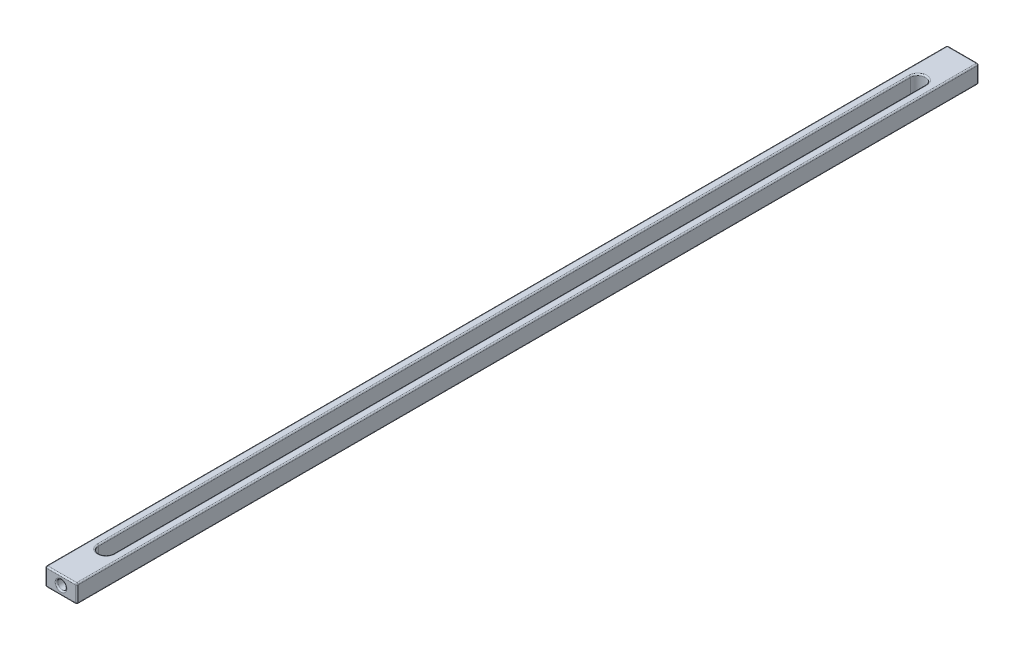
ISO-10303-21;
HEADER;
FILE_DESCRIPTION(('STEP AP214'),'2;1');
FILE_NAME('part.step','',(''),(''),'','','');
FILE_SCHEMA(('AUTOMOTIVE_DESIGN { 1 0 10303 214 1 1 1 1 }'));
ENDSEC;
DATA;
#1=APPLICATION_CONTEXT('core data for automotive mechanical design processes');
#2=APPLICATION_PROTOCOL_DEFINITION('international standard','automotive_design',2000,#1);
#3=PRODUCT_CONTEXT('',#1,'mechanical');
#4=PRODUCT('Part','Part','',(#3));
#5=PRODUCT_RELATED_PRODUCT_CATEGORY('part','',(#4));
#6=PRODUCT_DEFINITION_FORMATION('','',#4);
#7=PRODUCT_DEFINITION_CONTEXT('part definition',#1,'design');
#8=PRODUCT_DEFINITION('design','',#6,#7);
#9=PRODUCT_DEFINITION_SHAPE('','',#8);
#10=(LENGTH_UNIT() NAMED_UNIT(*) SI_UNIT(.MILLI.,.METRE.));
#11=(NAMED_UNIT(*) PLANE_ANGLE_UNIT() SI_UNIT($,.RADIAN.));
#12=(NAMED_UNIT(*) SI_UNIT($,.STERADIAN.) SOLID_ANGLE_UNIT());
#13=UNCERTAINTY_MEASURE_WITH_UNIT(LENGTH_MEASURE(1.E-05),#10,'distance_accuracy_value','');
#14=(GEOMETRIC_REPRESENTATION_CONTEXT(3) GLOBAL_UNCERTAINTY_ASSIGNED_CONTEXT((#13)) GLOBAL_UNIT_ASSIGNED_CONTEXT((#10,
#11,#12)) REPRESENTATION_CONTEXT('',''));
#15=CARTESIAN_POINT('',(0.,0.,0.));
#16=DIRECTION('',(0.,0.,1.));
#17=DIRECTION('',(1.,0.,0.));
#18=AXIS2_PLACEMENT_3D('',#15,#16,#17);
#19=CARTESIAN_POINT('',(3.5,-2.,200.));
#20=DIRECTION('',(-1.,0.,0.));
#21=DIRECTION('',(0.,0.,1.));
#22=AXIS2_PLACEMENT_3D('',#19,#20,#21);
#23=PLANE('',#22);
#24=DIRECTION('',(0.,1.,0.));
#25=VECTOR('',#24,1.);
#26=CARTESIAN_POINT('',(3.5,-2.,199.7));
#27=LINE('',#26,#25);
#28=CARTESIAN_POINT('',(3.5,1.7,199.7));
#29=VERTEX_POINT('',#28);
#30=CARTESIAN_POINT('',(3.5,-1.7,199.7));
#31=VERTEX_POINT('',#30);
#32=EDGE_CURVE('E375',#29,#31,#27,.F.);
#33=ORIENTED_EDGE('',*,*,#32,.T.);
#34=DIRECTION('',(0.,0.,-1.));
#35=VECTOR('',#34,1.);
#36=CARTESIAN_POINT('',(3.5,-1.7,200.));
#37=LINE('',#36,#35);
#38=CARTESIAN_POINT('',(3.5,-1.7,0.299999999999995));
#39=VERTEX_POINT('',#38);
#40=EDGE_CURVE('E367',#31,#39,#37,.T.);
#41=ORIENTED_EDGE('',*,*,#40,.T.);
#42=DIRECTION('',(0.,1.,0.));
#43=VECTOR('',#42,1.);
#44=CARTESIAN_POINT('',(3.5,2.,0.299999999999995));
#45=LINE('',#44,#43);
#46=CARTESIAN_POINT('',(3.5,1.7,0.299999999999995));
#47=VERTEX_POINT('',#46);
#48=EDGE_CURVE('E384',#39,#47,#45,.T.);
#49=ORIENTED_EDGE('',*,*,#48,.T.);
#50=DIRECTION('',(0.,0.,-1.));
#51=VECTOR('',#50,1.);
#52=CARTESIAN_POINT('',(3.5,1.7,200.));
#53=LINE('',#52,#51);
#54=EDGE_CURVE('E379',#47,#29,#53,.F.);
#55=ORIENTED_EDGE('',*,*,#54,.T.);
#56=EDGE_LOOP('',(#33,#41,#49,#55));
#57=FACE_BOUND('',#56,.T.);
#58=ADVANCED_FACE('F42',(#57),#23,.F.);
#59=CARTESIAN_POINT('',(-3.5,2.,200.));
#60=DIRECTION('',(0.,-1.,0.));
#61=DIRECTION('',(0.,0.,-1.));
#62=AXIS2_PLACEMENT_3D('',#59,#60,#61);
#63=PLANE('',#62);
#64=DIRECTION('',(0.,0.,1.));
#65=VECTOR('',#64,1.);
#66=CARTESIAN_POINT('',(-1.95,2.,200.));
#67=LINE('',#66,#65);
#68=CARTESIAN_POINT('',(-1.95,2.,190.));
#69=VERTEX_POINT('',#68);
#70=CARTESIAN_POINT('',(-1.95,2.,10.));
#71=VERTEX_POINT('',#70);
#72=EDGE_CURVE('E322',#69,#71,#67,.F.);
#73=ORIENTED_EDGE('',*,*,#72,.T.);
#74=CARTESIAN_POINT('',(0.,2.,10.));
#75=DIRECTION('',(0.,-1.,0.));
#76=DIRECTION('',(0.,0.,-1.));
#77=AXIS2_PLACEMENT_3D('',#74,#75,#76);
#78=CIRCLE('',#77,1.95);
#79=CARTESIAN_POINT('',(1.95,2.,10.));
#80=VERTEX_POINT('',#79);
#81=EDGE_CURVE('E326',#71,#80,#78,.T.);
#82=ORIENTED_EDGE('',*,*,#81,.T.);
#83=DIRECTION('',(0.,0.,-1.));
#84=VECTOR('',#83,1.);
#85=CARTESIAN_POINT('',(1.95,2.,200.));
#86=LINE('',#85,#84);
#87=CARTESIAN_POINT('',(1.95,2.,190.));
#88=VERTEX_POINT('',#87);
#89=EDGE_CURVE('E312',#80,#88,#86,.F.);
#90=ORIENTED_EDGE('',*,*,#89,.T.);
#91=CARTESIAN_POINT('',(0.,2.,190.));
#92=DIRECTION('',(0.,-1.,0.));
#93=DIRECTION('',(0.,0.,-1.));
#94=AXIS2_PLACEMENT_3D('',#91,#92,#93);
#95=CIRCLE('',#94,1.95);
#96=EDGE_CURVE('E319',#88,#69,#95,.T.);
#97=ORIENTED_EDGE('',*,*,#96,.T.);
#98=EDGE_LOOP('',(#73,#82,#90,#97));
#99=FACE_BOUND('',#98,.T.);
#100=DIRECTION('',(-1.,0.,0.));
#101=VECTOR('',#100,1.);
#102=CARTESIAN_POINT('',(-3.5,2.,199.7));
#103=LINE('',#102,#101);
#104=CARTESIAN_POINT('',(-3.2,2.,199.7));
#105=VERTEX_POINT('',#104);
#106=CARTESIAN_POINT('',(3.2,2.,199.7));
#107=VERTEX_POINT('',#106);
#108=EDGE_CURVE('E214',#105,#107,#103,.F.);
#109=ORIENTED_EDGE('',*,*,#108,.T.);
#110=DIRECTION('',(0.,0.,-1.));
#111=VECTOR('',#110,1.);
#112=CARTESIAN_POINT('',(3.2,2.,200.));
#113=LINE('',#112,#111);
#114=CARTESIAN_POINT('',(3.2,2.,0.299999999999995));
#115=VERTEX_POINT('',#114);
#116=EDGE_CURVE('E328',#107,#115,#113,.T.);
#117=ORIENTED_EDGE('',*,*,#116,.T.);
#118=DIRECTION('',(-1.,0.,0.));
#119=VECTOR('',#118,1.);
#120=CARTESIAN_POINT('',(-3.5,2.,0.299999999999995));
#121=LINE('',#120,#119);
#122=CARTESIAN_POINT('',(-3.2,2.,0.299999999999995));
#123=VERTEX_POINT('',#122);
#124=EDGE_CURVE('E455',#115,#123,#121,.T.);
#125=ORIENTED_EDGE('',*,*,#124,.T.);
#126=DIRECTION('',(0.,0.,-1.));
#127=VECTOR('',#126,1.);
#128=CARTESIAN_POINT('',(-3.2,2.,200.));
#129=LINE('',#128,#127);
#130=EDGE_CURVE('E452',#123,#105,#129,.F.);
#131=ORIENTED_EDGE('',*,*,#130,.T.);
#132=EDGE_LOOP('',(#109,#117,#125,#131));
#133=FACE_BOUND('',#132,.T.);
#134=ADVANCED_FACE('F463',(#99,#133),#63,.F.);
#135=CARTESIAN_POINT('',(-3.5,-2.,200.));
#136=DIRECTION('',(1.,0.,0.));
#137=DIRECTION('',(0.,0.,-1.));
#138=AXIS2_PLACEMENT_3D('',#135,#136,#137);
#139=PLANE('',#138);
#140=DIRECTION('',(0.,-1.,0.));
#141=VECTOR('',#140,1.);
#142=CARTESIAN_POINT('',(-3.5,-2.,199.7));
#143=LINE('',#142,#141);
#144=CARTESIAN_POINT('',(-3.5,-1.7,199.7));
#145=VERTEX_POINT('',#144);
#146=CARTESIAN_POINT('',(-3.5,1.7,199.7));
#147=VERTEX_POINT('',#146);
#148=EDGE_CURVE('E52',#145,#147,#143,.F.);
#149=ORIENTED_EDGE('',*,*,#148,.T.);
#150=DIRECTION('',(0.,0.,-1.));
#151=VECTOR('',#150,1.);
#152=CARTESIAN_POINT('',(-3.5,1.7,200.));
#153=LINE('',#152,#151);
#154=CARTESIAN_POINT('',(-3.5,1.7,0.299999999999995));
#155=VERTEX_POINT('',#154);
#156=EDGE_CURVE('E11',#147,#155,#153,.T.);
#157=ORIENTED_EDGE('',*,*,#156,.T.);
#158=DIRECTION('',(0.,-1.,0.));
#159=VECTOR('',#158,1.);
#160=CARTESIAN_POINT('',(-3.5,-2.,0.299999999999995));
#161=LINE('',#160,#159);
#162=CARTESIAN_POINT('',(-3.5,-1.7,0.299999999999995));
#163=VERTEX_POINT('',#162);
#164=EDGE_CURVE('E334',#155,#163,#161,.T.);
#165=ORIENTED_EDGE('',*,*,#164,.T.);
#166=DIRECTION('',(0.,0.,-1.));
#167=VECTOR('',#166,1.);
#168=CARTESIAN_POINT('',(-3.5,-1.7,200.));
#169=LINE('',#168,#167);
#170=EDGE_CURVE('E63',#163,#145,#169,.F.);
#171=ORIENTED_EDGE('',*,*,#170,.T.);
#172=EDGE_LOOP('',(#149,#157,#165,#171));
#173=FACE_BOUND('',#172,.T.);
#174=ADVANCED_FACE('F507',(#173),#139,.F.);
#175=CARTESIAN_POINT('',(-3.5,-2.,200.));
#176=DIRECTION('',(0.,1.,0.));
#177=DIRECTION('',(0.,0.,1.));
#178=AXIS2_PLACEMENT_3D('',#175,#176,#177);
#179=PLANE('',#178);
#180=DIRECTION('',(0.,0.,-1.));
#181=VECTOR('',#180,1.);
#182=CARTESIAN_POINT('',(1.95,-2.,200.));
#183=LINE('',#182,#181);
#184=CARTESIAN_POINT('',(1.95,-2.,190.));
#185=VERTEX_POINT('',#184);
#186=CARTESIAN_POINT('',(1.95,-2.,10.));
#187=VERTEX_POINT('',#186);
#188=EDGE_CURVE('E421',#185,#187,#183,.T.);
#189=ORIENTED_EDGE('',*,*,#188,.T.);
#190=CARTESIAN_POINT('',(0.,-2.,10.));
#191=DIRECTION('',(0.,1.,0.));
#192=DIRECTION('',(0.,0.,1.));
#193=AXIS2_PLACEMENT_3D('',#190,#191,#192);
#194=CIRCLE('',#193,1.95);
#195=CARTESIAN_POINT('',(-1.95,-2.,10.));
#196=VERTEX_POINT('',#195);
#197=EDGE_CURVE('E424',#187,#196,#194,.T.);
#198=ORIENTED_EDGE('',*,*,#197,.T.);
#199=DIRECTION('',(0.,0.,1.));
#200=VECTOR('',#199,1.);
#201=CARTESIAN_POINT('',(-1.95,-2.,200.));
#202=LINE('',#201,#200);
#203=CARTESIAN_POINT('',(-1.95,-2.,190.));
#204=VERTEX_POINT('',#203);
#205=EDGE_CURVE('E415',#196,#204,#202,.T.);
#206=ORIENTED_EDGE('',*,*,#205,.T.);
#207=CARTESIAN_POINT('',(0.,-2.,190.));
#208=DIRECTION('',(0.,1.,0.));
#209=DIRECTION('',(0.,0.,1.));
#210=AXIS2_PLACEMENT_3D('',#207,#208,#209);
#211=CIRCLE('',#210,1.95);
#212=EDGE_CURVE('E418',#204,#185,#211,.T.);
#213=ORIENTED_EDGE('',*,*,#212,.T.);
#214=EDGE_LOOP('',(#189,#198,#206,#213));
#215=FACE_BOUND('',#214,.T.);
#216=DIRECTION('',(0.,0.,-1.));
#217=VECTOR('',#216,1.);
#218=CARTESIAN_POINT('',(3.2,-2.,200.));
#219=LINE('',#218,#217);
#220=CARTESIAN_POINT('',(3.2,-2.,0.299999999999995));
#221=VERTEX_POINT('',#220);
#222=CARTESIAN_POINT('',(3.2,-2.,199.7));
#223=VERTEX_POINT('',#222);
#224=EDGE_CURVE('E408',#221,#223,#219,.F.);
#225=ORIENTED_EDGE('',*,*,#224,.T.);
#226=DIRECTION('',(1.,0.,0.));
#227=VECTOR('',#226,1.);
#228=CARTESIAN_POINT('',(-3.5,-2.,199.7));
#229=LINE('',#228,#227);
#230=CARTESIAN_POINT('',(-3.2,-2.,199.7));
#231=VERTEX_POINT('',#230);
#232=EDGE_CURVE('E411',#223,#231,#229,.F.);
#233=ORIENTED_EDGE('',*,*,#232,.T.);
#234=DIRECTION('',(0.,0.,-1.));
#235=VECTOR('',#234,1.);
#236=CARTESIAN_POINT('',(-3.2,-2.,200.));
#237=LINE('',#236,#235);
#238=CARTESIAN_POINT('',(-3.2,-2.,0.299999999999995));
#239=VERTEX_POINT('',#238);
#240=EDGE_CURVE('E402',#231,#239,#237,.T.);
#241=ORIENTED_EDGE('',*,*,#240,.T.);
#242=DIRECTION('',(1.,0.,0.));
#243=VECTOR('',#242,1.);
#244=CARTESIAN_POINT('',(3.5,-2.,0.299999999999995));
#245=LINE('',#244,#243);
#246=EDGE_CURVE('E405',#239,#221,#245,.T.);
#247=ORIENTED_EDGE('',*,*,#246,.T.);
#248=EDGE_LOOP('',(#225,#233,#241,#247));
#249=FACE_BOUND('',#248,.T.);
#250=ADVANCED_FACE('F498',(#215,#249),#179,.F.);
#251=CARTESIAN_POINT('',(0.,0.,200.));
#252=DIRECTION('',(0.,0.,-1.));
#253=DIRECTION('',(-1.,0.,0.));
#254=AXIS2_PLACEMENT_3D('',#251,#252,#253);
#255=PLANE('',#254);
#256=CARTESIAN_POINT('',(0.,0.,200.));
#257=DIRECTION('',(0.,0.,-1.));
#258=DIRECTION('',(-1.,0.,0.));
#259=AXIS2_PLACEMENT_3D('',#256,#257,#258);
#260=CIRCLE('',#259,1.3);
#261=CARTESIAN_POINT('',(-1.3,0.,200.));
#262=VERTEX_POINT('',#261);
#263=EDGE_CURVE('E472',#262,#262,#260,.T.);
#264=ORIENTED_EDGE('',*,*,#263,.T.);
#265=EDGE_LOOP('',(#264));
#266=FACE_BOUND('',#265,.T.);
#267=DIRECTION('',(1.,0.,0.));
#268=VECTOR('',#267,1.);
#269=CARTESIAN_POINT('',(0.,-1.7,200.));
#270=LINE('',#269,#268);
#271=CARTESIAN_POINT('',(-3.2,-1.7,200.));
#272=VERTEX_POINT('',#271);
#273=CARTESIAN_POINT('',(3.2,-1.7,200.));
#274=VERTEX_POINT('',#273);
#275=EDGE_CURVE('E190',#272,#274,#270,.T.);
#276=ORIENTED_EDGE('',*,*,#275,.T.);
#277=DIRECTION('',(0.,1.,0.));
#278=VECTOR('',#277,1.);
#279=CARTESIAN_POINT('',(3.2,0.,200.));
#280=LINE('',#279,#278);
#281=CARTESIAN_POINT('',(3.2,1.7,200.));
#282=VERTEX_POINT('',#281);
#283=EDGE_CURVE('E185',#274,#282,#280,.T.);
#284=ORIENTED_EDGE('',*,*,#283,.T.);
#285=DIRECTION('',(-1.,0.,0.));
#286=VECTOR('',#285,1.);
#287=CARTESIAN_POINT('',(0.,1.7,200.));
#288=LINE('',#287,#286);
#289=CARTESIAN_POINT('',(-3.2,1.7,200.));
#290=VERTEX_POINT('',#289);
#291=EDGE_CURVE('E179',#282,#290,#288,.T.);
#292=ORIENTED_EDGE('',*,*,#291,.T.);
#293=DIRECTION('',(0.,-1.,0.));
#294=VECTOR('',#293,1.);
#295=CARTESIAN_POINT('',(-3.2,0.,200.));
#296=LINE('',#295,#294);
#297=EDGE_CURVE('E182',#290,#272,#296,.T.);
#298=ORIENTED_EDGE('',*,*,#297,.T.);
#299=EDGE_LOOP('',(#276,#284,#292,#298));
#300=FACE_BOUND('',#299,.T.);
#301=ADVANCED_FACE('F181',(#266,#300),#255,.F.);
#302=CARTESIAN_POINT('',(0.,0.,0.));
#303=DIRECTION('',(0.,0.,-1.));
#304=DIRECTION('',(-1.,0.,0.));
#305=AXIS2_PLACEMENT_3D('',#302,#303,#304);
#306=PLANE('',#305);
#307=DIRECTION('',(-1.,0.,0.));
#308=VECTOR('',#307,1.);
#309=CARTESIAN_POINT('',(3.5,1.7,0.));
#310=LINE('',#309,#308);
#311=CARTESIAN_POINT('',(-3.2,1.7,0.));
#312=VERTEX_POINT('',#311);
#313=CARTESIAN_POINT('',(3.2,1.7,0.));
#314=VERTEX_POINT('',#313);
#315=EDGE_CURVE('E392',#312,#314,#310,.F.);
#316=ORIENTED_EDGE('',*,*,#315,.T.);
#317=DIRECTION('',(0.,1.,0.));
#318=VECTOR('',#317,1.);
#319=CARTESIAN_POINT('',(3.2,-2.,0.));
#320=LINE('',#319,#318);
#321=CARTESIAN_POINT('',(3.2,-1.7,0.));
#322=VERTEX_POINT('',#321);
#323=EDGE_CURVE('E398',#314,#322,#320,.F.);
#324=ORIENTED_EDGE('',*,*,#323,.T.);
#325=DIRECTION('',(1.,0.,0.));
#326=VECTOR('',#325,1.);
#327=CARTESIAN_POINT('',(-3.5,-1.7,0.));
#328=LINE('',#327,#326);
#329=CARTESIAN_POINT('',(-3.2,-1.7,0.));
#330=VERTEX_POINT('',#329);
#331=EDGE_CURVE('E395',#322,#330,#328,.F.);
#332=ORIENTED_EDGE('',*,*,#331,.T.);
#333=DIRECTION('',(0.,-1.,0.));
#334=VECTOR('',#333,1.);
#335=CARTESIAN_POINT('',(-3.2,2.,0.));
#336=LINE('',#335,#334);
#337=EDGE_CURVE('E374',#330,#312,#336,.F.);
#338=ORIENTED_EDGE('',*,*,#337,.T.);
#339=EDGE_LOOP('',(#316,#324,#332,#338));
#340=FACE_BOUND('',#339,.T.);
#341=ADVANCED_FACE('F497',(#340),#306,.T.);
#342=CARTESIAN_POINT('',(0.,-2.,190.));
#343=DIRECTION('',(0.,1.,0.));
#344=DIRECTION('',(0.,0.,1.));
#345=AXIS2_PLACEMENT_3D('',#342,#343,#344);
#346=CYLINDRICAL_SURFACE('',#345,1.65);
#347=CARTESIAN_POINT('',(1.,0.,191.312440474841));
#348=CARTESIAN_POINT('',(0.999992891906005,-0.0500898534810641,191.31245074851));
#349=CARTESIAN_POINT('',(0.996202861808362,-0.100257740363258,191.315360954646));
#350=CARTESIAN_POINT('',(0.981288359718212,-0.198955499934667,191.326518758679));
#351=CARTESIAN_POINT('',(0.970141360798812,-0.247479858870671,191.334782748346));
#352=CARTESIAN_POINT('',(0.941275413256835,-0.341150806345517,191.355288995935));
#353=CARTESIAN_POINT('',(0.923610510113965,-0.386321602349798,191.367498438155));
#354=CARTESIAN_POINT('',(0.882368228055637,-0.473004177977371,191.394464776211));
#355=CARTESIAN_POINT('',(0.858791377539072,-0.514516284159676,191.409221444343));
#356=CARTESIAN_POINT('',(0.802950453751545,-0.598429944107904,191.441853479334));
#357=CARTESIAN_POINT('',(0.769968238934895,-0.640291915961142,191.459887981542));
#358=CARTESIAN_POINT('',(0.697721443486969,-0.71834232445229,191.495765415272));
#359=CARTESIAN_POINT('',(0.658451636339762,-0.754525991054869,191.513608174125));
#360=CARTESIAN_POINT('',(0.569464670165295,-0.824162134860669,191.549437086389));
#361=CARTESIAN_POINT('',(0.519071818717614,-0.856866378742204,191.567219581116));
#362=CARTESIAN_POINT('',(0.412216558666383,-0.913077681481214,191.598645541857));
#363=CARTESIAN_POINT('',(0.355759918307477,-0.936593383965515,191.612292895057));
#364=CARTESIAN_POINT('',(0.244159695470438,-0.971319605261848,191.632723240793));
#365=CARTESIAN_POINT('',(0.189419465682028,-0.983502080920507,191.640043457763));
#366=CARTESIAN_POINT('',(0.0782341545455377,-0.998507393056119,191.649084323261));
#367=CARTESIAN_POINT('',(0.0217907745642698,-1.00133927710187,191.650810384626));
#368=CARTESIAN_POINT('',(-0.0834967236135018,-0.997720816280997,191.648619936762));
#369=CARTESIAN_POINT('',(-0.132399342022815,-0.992398824901194,191.64538926855));
#370=CARTESIAN_POINT('',(-0.228463921661359,-0.974776232112748,191.63482074073));
#371=CARTESIAN_POINT('',(-0.275625751335032,-0.962475104419477,191.627482571384));
#372=CARTESIAN_POINT('',(-0.367284066454235,-0.931374691763909,191.609285423447));
#373=CARTESIAN_POINT('',(-0.411765839198966,-0.912542803468123,191.598408797105));
#374=CARTESIAN_POINT('',(-0.496987952079726,-0.869076277041744,191.573998261964));
#375=CARTESIAN_POINT('',(-0.537727347548508,-0.844440179351034,191.560463684922));
#376=CARTESIAN_POINT('',(-0.619581160224081,-0.786715759777838,191.529950775741));
#377=CARTESIAN_POINT('',(-0.660147221933666,-0.752966136278898,191.512753958676));
#378=CARTESIAN_POINT('',(-0.735389550896807,-0.679680758933539,191.4776435285));
#379=CARTESIAN_POINT('',(-0.770057543381042,-0.640137018491464,191.459728951201));
#380=CARTESIAN_POINT('',(-0.836709743423909,-0.550803244722168,191.422686127755));
#381=CARTESIAN_POINT('',(-0.867879021432356,-0.500353535801969,191.403668435049));
#382=CARTESIAN_POINT('',(-0.921138675527927,-0.393746980061776,191.369311128578));
#383=CARTESIAN_POINT('',(-0.943245830165945,-0.337600922808479,191.353964739529));
#384=CARTESIAN_POINT('',(-0.972903105006646,-0.235640761664382,191.332743259786));
#385=CARTESIAN_POINT('',(-0.982715957530634,-0.190779355854396,191.325456848813));
#386=CARTESIAN_POINT('',(-0.996083664027095,-0.0996549244201849,191.315443007256));
#387=CARTESIAN_POINT('',(-0.999646092182795,-0.0533936644037906,191.312710059048));
#388=CARTESIAN_POINT('',(-1.00030407295267,0.0392747569024088,191.312208861126));
#389=CARTESIAN_POINT('',(-0.997389372797763,0.0856820332277086,191.314448482583));
#390=CARTESIAN_POINT('',(-0.985257425900156,0.177208964809157,191.323564342837));
#391=CARTESIAN_POINT('',(-0.976035127502633,0.222327557784528,191.330444297942));
#392=CARTESIAN_POINT('',(-0.951826921463956,0.309976810467292,191.347866355162));
#393=CARTESIAN_POINT('',(-0.936868068026405,0.352518548505209,191.358391245125));
#394=CARTESIAN_POINT('',(-0.901722807284138,0.434617777168328,191.381970700993));
#395=CARTESIAN_POINT('',(-0.881534460594877,0.474174153613827,191.395026204935));
#396=CARTESIAN_POINT('',(-0.832246963566266,0.556853669486945,191.425075914108));
#397=CARTESIAN_POINT('',(-0.802193296723893,0.599305346153731,191.442353726133));
#398=CARTESIAN_POINT('',(-0.735957381703735,0.679010927703111,191.47725112707));
#399=CARTESIAN_POINT('',(-0.699769127556231,0.716259672919027,191.494871035793));
#400=CARTESIAN_POINT('',(-0.616378866043871,0.789663495293648,191.531312658226));
#401=CARTESIAN_POINT('',(-0.568347151747222,0.824969205240549,191.54996817862));
#402=CARTESIAN_POINT('',(-0.465852532486685,0.886880969868281,191.583788516149));
#403=CARTESIAN_POINT('',(-0.411393668936831,0.913492452252578,191.598955509373));
#404=CARTESIAN_POINT('',(-0.301454768499318,0.95516096905493,191.623134497872));
#405=CARTESIAN_POINT('',(-0.246313492459553,0.970896808020903,191.632503225289));
#406=CARTESIAN_POINT('',(-0.133520401174229,0.992703517104623,191.645564230494));
#407=CARTESIAN_POINT('',(-0.0758716576857141,0.998785888589767,191.649263263108));
#408=CARTESIAN_POINT('',(0.0317301524689535,1.00074209980074,191.650450554093));
#409=CARTESIAN_POINT('',(0.0816566843456881,0.997899116554556,191.648719511925));
#410=CARTESIAN_POINT('',(0.180186405083734,0.984886347528643,191.640875933821));
#411=CARTESIAN_POINT('',(0.228789594558345,0.974716565144555,191.634763399916));
#412=CARTESIAN_POINT('',(0.322398114490378,0.947831998346424,191.618879618381));
#413=CARTESIAN_POINT('',(0.367456377474388,0.931253947058802,191.609184981155));
#414=CARTESIAN_POINT('',(0.454148460305579,0.892194843397011,191.58690098321));
#415=CARTESIAN_POINT('',(0.495781577577216,0.869712583880103,191.574311030595));
#416=CARTESIAN_POINT('',(0.579283280581429,0.816781192993079,191.545665864323));
#417=CARTESIAN_POINT('',(0.620694288139693,0.785734799355384,191.529383474533));
#418=CARTESIAN_POINT('',(0.698038335348332,0.717908867181752,191.495669297977));
#419=CARTESIAN_POINT('',(0.733964926953671,0.681122681505779,191.478236192268));
#420=CARTESIAN_POINT('',(0.804175232746233,0.597224237690989,191.441378176601));
#421=CARTESIAN_POINT('',(0.837622642108792,0.549390275098919,191.421992571758));
#422=CARTESIAN_POINT('',(0.896025133268811,0.447838587898505,191.385936448939));
#423=CARTESIAN_POINT('',(0.920986834018434,0.394125492518259,191.369263820127));
#424=CARTESIAN_POINT('',(0.956793611253704,0.294435753194493,191.344399716371));
#425=CARTESIAN_POINT('',(0.969546181357548,0.24940937895277,191.335145775233));
#426=CARTESIAN_POINT('',(0.988637956504351,0.157425945468713,191.321076135038));
#427=CARTESIAN_POINT('',(0.994998502331492,0.110475859021622,191.316245672326));
#428=CARTESIAN_POINT('',(0.999334019505404,0.0422084197791255,191.312946938814));
#429=CARTESIAN_POINT('',(1.00000299581574,0.0211111405466594,191.312436144844));
#430=CARTESIAN_POINT('',(1.,0.,191.312440474841));
#431=B_SPLINE_CURVE_WITH_KNOTS('',3,(#347,#348,#349,#350,#351,#352,#353,#354,#355,#356,#357,
#358,#359,#360,#361,#362,#363,#364,#365,#366,#367,#368,#369,#370,#371,#372,#373,#374,#375,#376,
#377,#378,#379,#380,#381,#382,#383,#384,#385,#386,#387,#388,#389,#390,#391,#392,#393,#394,#395,
#396,#397,#398,#399,#400,#401,#402,#403,#404,#405,#406,#407,#408,#409,#410,#411,#412,#413,#414,
#415,#416,#417,#418,#419,#420,#421,#422,#423,#424,#425,#426,#427,#428,#429,#430),.UNSPECIFIED.,
.T.,.F.,(4,2,2,2,2,2,2,2,2,2,2,2,2,2,2,2,2,2,2,2,2,2,2,2,2,2,2,2,2,2,2,2,2,2,2,2,2,2,2,2,2,4),
(0.,0.150193099162792,0.300848234289528,0.450281248255208,0.599700910932903,0.767831637820421,
0.936102854747141,1.12304048601377,1.30980183993223,1.47845666875518,1.64694826041802,
1.79413612924745,1.94133509873561,2.08927976363656,2.23726167134361,2.40310670267488,
2.56918252320928,2.75509152698236,2.9406547477544,3.07955068458849,3.21827819257822,
3.35722545136276,3.49628412129776,3.63469488440819,3.77315705153628,3.93695115574779,
4.10090655602171,4.28732983769736,4.47363651414182,4.64689245364445,4.81994181658512,
4.96930836880425,5.11867485179872,5.26501609264268,5.41138727695695,5.57352303217243,
5.73584796663719,5.91950420804278,6.10301686495543,6.2455564629444,6.38761857294607,
6.45091976880128),.UNSPECIFIED.);
#432=CARTESIAN_POINT('',(1.,0.,191.312440474841));
#433=VERTEX_POINT('',#432);
#434=EDGE_CURVE('E276',#433,#433,#431,.T.);
#435=ORIENTED_EDGE('',*,*,#434,.F.);
#436=EDGE_LOOP('',(#435));
#437=FACE_BOUND('',#436,.T.);
#438=DIRECTION('',(0.,1.,0.));
#439=VECTOR('',#438,1.);
#440=CARTESIAN_POINT('',(1.65,-2.,190.));
#441=LINE('',#440,#439);
#442=CARTESIAN_POINT('',(1.65,-1.7,190.));
#443=VERTEX_POINT('',#442);
#444=CARTESIAN_POINT('',(1.65,1.7,190.));
#445=VERTEX_POINT('',#444);
#446=EDGE_CURVE('E957',#443,#445,#441,.T.);
#447=ORIENTED_EDGE('',*,*,#446,.F.);
#448=CARTESIAN_POINT('',(0.,-1.7,190.));
#449=DIRECTION('',(0.,1.,0.));
#450=DIRECTION('',(0.,0.,1.));
#451=AXIS2_PLACEMENT_3D('',#448,#449,#450);
#452=CIRCLE('',#451,1.65);
#453=CARTESIAN_POINT('',(-1.65,-1.7,190.));
#454=VERTEX_POINT('',#453);
#455=EDGE_CURVE('E443',#443,#454,#452,.F.);
#456=ORIENTED_EDGE('',*,*,#455,.T.);
#457=DIRECTION('',(0.,1.,0.));
#458=VECTOR('',#457,1.);
#459=CARTESIAN_POINT('',(-1.65,-2.,190.));
#460=LINE('',#459,#458);
#461=CARTESIAN_POINT('',(-1.65,1.7,190.));
#462=VERTEX_POINT('',#461);
#463=EDGE_CURVE('E202',#454,#462,#460,.T.);
#464=ORIENTED_EDGE('',*,*,#463,.T.);
#465=CARTESIAN_POINT('',(0.,1.7,190.));
#466=DIRECTION('',(0.,-1.,0.));
#467=DIRECTION('',(0.,0.,-1.));
#468=AXIS2_PLACEMENT_3D('',#465,#466,#467);
#469=CIRCLE('',#468,1.65);
#470=EDGE_CURVE('E318',#462,#445,#469,.F.);
#471=ORIENTED_EDGE('',*,*,#470,.T.);
#472=EDGE_LOOP('',(#447,#456,#464,#471));
#473=FACE_BOUND('',#472,.T.);
#474=ADVANCED_FACE('F504',(#437,#473),#346,.F.);
#475=CARTESIAN_POINT('',(-1.65,-2.,190.));
#476=DIRECTION('',(-1.,0.,0.));
#477=DIRECTION('',(0.,0.,1.));
#478=AXIS2_PLACEMENT_3D('',#475,#476,#477);
#479=PLANE('',#478);
#480=ORIENTED_EDGE('',*,*,#463,.F.);
#481=DIRECTION('',(0.,0.,1.));
#482=VECTOR('',#481,1.);
#483=CARTESIAN_POINT('',(-1.65,-1.7,190.));
#484=LINE('',#483,#482);
#485=CARTESIAN_POINT('',(-1.65,-1.7,10.));
#486=VERTEX_POINT('',#485);
#487=EDGE_CURVE('E449',#454,#486,#484,.F.);
#488=ORIENTED_EDGE('',*,*,#487,.T.);
#489=DIRECTION('',(0.,1.,0.));
#490=VECTOR('',#489,1.);
#491=CARTESIAN_POINT('',(-1.65,-2.,10.));
#492=LINE('',#491,#490);
#493=CARTESIAN_POINT('',(-1.65,1.7,10.));
#494=VERTEX_POINT('',#493);
#495=EDGE_CURVE('E961',#486,#494,#492,.T.);
#496=ORIENTED_EDGE('',*,*,#495,.T.);
#497=DIRECTION('',(0.,0.,1.));
#498=VECTOR('',#497,1.);
#499=CARTESIAN_POINT('',(-1.65,1.7,190.));
#500=LINE('',#499,#498);
#501=EDGE_CURVE('E446',#494,#462,#500,.T.);
#502=ORIENTED_EDGE('',*,*,#501,.T.);
#503=EDGE_LOOP('',(#480,#488,#496,#502));
#504=FACE_BOUND('',#503,.T.);
#505=ADVANCED_FACE('F731',(#504),#479,.F.);
#506=CARTESIAN_POINT('',(0.,-2.,10.));
#507=DIRECTION('',(0.,1.,0.));
#508=DIRECTION('',(0.,0.,1.));
#509=AXIS2_PLACEMENT_3D('',#506,#507,#508);
#510=CYLINDRICAL_SURFACE('',#509,1.65);
#511=ORIENTED_EDGE('',*,*,#495,.F.);
#512=CARTESIAN_POINT('',(0.,-1.7,10.));
#513=DIRECTION('',(0.,1.,0.));
#514=DIRECTION('',(0.,0.,1.));
#515=AXIS2_PLACEMENT_3D('',#512,#513,#514);
#516=CIRCLE('',#515,1.65);
#517=CARTESIAN_POINT('',(1.65,-1.7,10.));
#518=VERTEX_POINT('',#517);
#519=EDGE_CURVE('E432',#486,#518,#516,.F.);
#520=ORIENTED_EDGE('',*,*,#519,.T.);
#521=DIRECTION('',(0.,1.,0.));
#522=VECTOR('',#521,1.);
#523=CARTESIAN_POINT('',(1.65,-2.,10.));
#524=LINE('',#523,#522);
#525=CARTESIAN_POINT('',(1.65,1.7,10.));
#526=VERTEX_POINT('',#525);
#527=EDGE_CURVE('E965',#518,#526,#524,.T.);
#528=ORIENTED_EDGE('',*,*,#527,.T.);
#529=CARTESIAN_POINT('',(0.,1.7,10.));
#530=DIRECTION('',(0.,-1.,0.));
#531=DIRECTION('',(0.,0.,-1.));
#532=AXIS2_PLACEMENT_3D('',#529,#530,#531);
#533=CIRCLE('',#532,1.65);
#534=EDGE_CURVE('E428',#526,#494,#533,.F.);
#535=ORIENTED_EDGE('',*,*,#534,.T.);
#536=EDGE_LOOP('',(#511,#520,#528,#535));
#537=FACE_BOUND('',#536,.T.);
#538=ADVANCED_FACE('F723',(#537),#510,.F.);
#539=CARTESIAN_POINT('',(1.65,-2.,190.));
#540=DIRECTION('',(1.,0.,0.));
#541=DIRECTION('',(0.,0.,-1.));
#542=AXIS2_PLACEMENT_3D('',#539,#540,#541);
#543=PLANE('',#542);
#544=ORIENTED_EDGE('',*,*,#527,.F.);
#545=DIRECTION('',(0.,0.,-1.));
#546=VECTOR('',#545,1.);
#547=CARTESIAN_POINT('',(1.65,-1.7,190.));
#548=LINE('',#547,#546);
#549=EDGE_CURVE('E438',#518,#443,#548,.F.);
#550=ORIENTED_EDGE('',*,*,#549,.T.);
#551=ORIENTED_EDGE('',*,*,#446,.T.);
#552=DIRECTION('',(0.,0.,-1.));
#553=VECTOR('',#552,1.);
#554=CARTESIAN_POINT('',(1.65,1.7,190.));
#555=LINE('',#554,#553);
#556=EDGE_CURVE('E314',#445,#526,#555,.T.);
#557=ORIENTED_EDGE('',*,*,#556,.T.);
#558=EDGE_LOOP('',(#544,#550,#551,#557));
#559=FACE_BOUND('',#558,.T.);
#560=ADVANCED_FACE('F716',(#559),#543,.F.);
#561=CARTESIAN_POINT('',(0.,0.,-0.001000000000001));
#562=DIRECTION('',(0.,0.,1.));
#563=DIRECTION('',(1.,0.,0.));
#564=AXIS2_PLACEMENT_3D('',#561,#562,#563);
#565=CYLINDRICAL_SURFACE('',#564,1.);
#566=CARTESIAN_POINT('',(0.,0.,199.7));
#567=DIRECTION('',(0.,0.,-1.));
#568=DIRECTION('',(-1.,0.,0.));
#569=AXIS2_PLACEMENT_3D('',#566,#567,#568);
#570=CIRCLE('',#569,1.);
#571=CARTESIAN_POINT('',(-1.,0.,199.7));
#572=VERTEX_POINT('',#571);
#573=EDGE_CURVE('E477',#572,#572,#570,.F.);
#574=ORIENTED_EDGE('',*,*,#573,.T.);
#575=EDGE_LOOP('',(#574));
#576=FACE_BOUND('',#575,.T.);
#577=ORIENTED_EDGE('',*,*,#434,.T.);
#578=EDGE_LOOP('',(#577));
#579=FACE_BOUND('',#578,.T.);
#580=ADVANCED_FACE('F486',(#576,#579),#565,.F.);
#581=CARTESIAN_POINT('',(0.,0.,199.7));
#582=DIRECTION('',(0.,0.,-1.));
#583=DIRECTION('',(-1.,0.,0.));
#584=AXIS2_PLACEMENT_3D('',#581,#582,#583);
#585=TOROIDAL_SURFACE('',#584,1.3,0.3);
#586=ORIENTED_EDGE('',*,*,#573,.F.);
#587=EDGE_LOOP('',(#586));
#588=FACE_BOUND('',#587,.T.);
#589=ORIENTED_EDGE('',*,*,#263,.F.);
#590=EDGE_LOOP('',(#589));
#591=FACE_BOUND('',#590,.T.);
#592=ADVANCED_FACE('F489',(#588,#591),#585,.T.);
#593=CARTESIAN_POINT('',(-3.2,-2.,0.299999999999995));
#594=DIRECTION('',(0.,1.,0.));
#595=DIRECTION('',(0.,0.,1.));
#596=AXIS2_PLACEMENT_3D('',#593,#594,#595);
#597=CYLINDRICAL_SURFACE('',#596,0.3);
#598=CARTESIAN_POINT('',(-3.2,-1.7,0.299999999999995));
#599=DIRECTION('',(0.,-1.,0.));
#600=DIRECTION('',(0.,0.,-1.));
#601=AXIS2_PLACEMENT_3D('',#598,#599,#600);
#602=CIRCLE('',#601,0.3);
#603=EDGE_CURVE('E272',#163,#330,#602,.T.);
#604=ORIENTED_EDGE('',*,*,#603,.F.);
#605=ORIENTED_EDGE('',*,*,#164,.F.);
#606=CARTESIAN_POINT('',(-3.2,1.7,0.3));
#607=DIRECTION('',(0.,1.,0.));
#608=DIRECTION('',(0.,0.,1.));
#609=AXIS2_PLACEMENT_3D('',#606,#607,#608);
#610=CIRCLE('',#609,0.3);
#611=EDGE_CURVE('E268',#312,#155,#610,.T.);
#612=ORIENTED_EDGE('',*,*,#611,.F.);
#613=ORIENTED_EDGE('',*,*,#337,.F.);
#614=EDGE_LOOP('',(#604,#605,#612,#613));
#615=FACE_BOUND('',#614,.T.);
#616=ADVANCED_FACE('F492',(#615),#597,.T.);
#617=CARTESIAN_POINT('',(-3.2,-1.7,0.3));
#618=DIRECTION('',(0.,0.,-1.));
#619=DIRECTION('',(-1.,0.,0.));
#620=AXIS2_PLACEMENT_3D('',#617,#618,#619);
#621=SPHERICAL_SURFACE('',#620,0.3);
#622=CARTESIAN_POINT('',(-3.2,-1.7,0.299999999999995));
#623=DIRECTION('',(0.,0.,-1.));
#624=DIRECTION('',(-1.,0.,0.));
#625=AXIS2_PLACEMENT_3D('',#622,#623,#624);
#626=CIRCLE('',#625,0.3);
#627=EDGE_CURVE('E260',#163,#239,#626,.F.);
#628=ORIENTED_EDGE('',*,*,#627,.F.);
#629=ORIENTED_EDGE('',*,*,#603,.T.);
#630=CARTESIAN_POINT('',(-3.2,-1.7,0.3));
#631=DIRECTION('',(-1.,0.,0.));
#632=DIRECTION('',(0.,0.,1.));
#633=AXIS2_PLACEMENT_3D('',#630,#631,#632);
#634=CIRCLE('',#633,0.3);
#635=EDGE_CURVE('E264',#239,#330,#634,.F.);
#636=ORIENTED_EDGE('',*,*,#635,.F.);
#637=EDGE_LOOP('',(#628,#629,#636));
#638=FACE_BOUND('',#637,.T.);
#639=ADVANCED_FACE('F575',(#638),#621,.T.);
#640=CARTESIAN_POINT('',(-3.2,1.7,0.3));
#641=DIRECTION('',(-1.,0.,0.));
#642=DIRECTION('',(0.,0.,1.));
#643=AXIS2_PLACEMENT_3D('',#640,#641,#642);
#644=SPHERICAL_SURFACE('',#643,0.3);
#645=CARTESIAN_POINT('',(-3.2,1.7,0.299999999999995));
#646=DIRECTION('',(-1.,0.,0.));
#647=DIRECTION('',(0.,0.,1.));
#648=AXIS2_PLACEMENT_3D('',#645,#646,#647);
#649=CIRCLE('',#648,0.3);
#650=EDGE_CURVE('E253',#312,#123,#649,.F.);
#651=ORIENTED_EDGE('',*,*,#650,.F.);
#652=ORIENTED_EDGE('',*,*,#611,.T.);
#653=CARTESIAN_POINT('',(-3.2,1.7,0.299999999999995));
#654=DIRECTION('',(0.,0.,-1.));
#655=DIRECTION('',(-1.,0.,0.));
#656=AXIS2_PLACEMENT_3D('',#653,#654,#655);
#657=CIRCLE('',#656,0.3);
#658=EDGE_CURVE('E257',#123,#155,#657,.F.);
#659=ORIENTED_EDGE('',*,*,#658,.F.);
#660=EDGE_LOOP('',(#651,#652,#659));
#661=FACE_BOUND('',#660,.T.);
#662=ADVANCED_FACE('F571',(#661),#644,.T.);
#663=CARTESIAN_POINT('',(-3.5,-1.7,0.299999999999995));
#664=DIRECTION('',(-1.,0.,0.));
#665=DIRECTION('',(0.,0.,1.));
#666=AXIS2_PLACEMENT_3D('',#663,#664,#665);
#667=CYLINDRICAL_SURFACE('',#666,0.3);
#668=ORIENTED_EDGE('',*,*,#635,.T.);
#669=ORIENTED_EDGE('',*,*,#331,.F.);
#670=CARTESIAN_POINT('',(3.2,-1.7,0.299999999999995));
#671=DIRECTION('',(1.,0.,0.));
#672=DIRECTION('',(0.,0.,-1.));
#673=AXIS2_PLACEMENT_3D('',#670,#671,#672);
#674=CIRCLE('',#673,0.3);
#675=EDGE_CURVE('E246',#221,#322,#674,.T.);
#676=ORIENTED_EDGE('',*,*,#675,.F.);
#677=ORIENTED_EDGE('',*,*,#246,.F.);
#678=EDGE_LOOP('',(#668,#669,#676,#677));
#679=FACE_BOUND('',#678,.T.);
#680=ADVANCED_FACE('F567',(#679),#667,.T.);
#681=CARTESIAN_POINT('',(-3.2,-1.7,200.));
#682=DIRECTION('',(0.,0.,-1.));
#683=DIRECTION('',(-1.,0.,0.));
#684=AXIS2_PLACEMENT_3D('',#681,#682,#683);
#685=CYLINDRICAL_SURFACE('',#684,0.3);
#686=ORIENTED_EDGE('',*,*,#627,.T.);
#687=ORIENTED_EDGE('',*,*,#240,.F.);
#688=CARTESIAN_POINT('',(-3.2,-1.7,199.7));
#689=DIRECTION('',(0.,0.,1.));
#690=DIRECTION('',(1.,0.,0.));
#691=AXIS2_PLACEMENT_3D('',#688,#689,#690);
#692=CIRCLE('',#691,0.3);
#693=EDGE_CURVE('E242',#145,#231,#692,.T.);
#694=ORIENTED_EDGE('',*,*,#693,.F.);
#695=ORIENTED_EDGE('',*,*,#170,.F.);
#696=EDGE_LOOP('',(#686,#687,#694,#695));
#697=FACE_BOUND('',#696,.T.);
#698=ADVANCED_FACE('F564',(#697),#685,.T.);
#699=CARTESIAN_POINT('',(-3.2,0.,199.7));
#700=DIRECTION('',(0.,-1.,0.));
#701=DIRECTION('',(0.,0.,-1.));
#702=AXIS2_PLACEMENT_3D('',#699,#700,#701);
#703=CYLINDRICAL_SURFACE('',#702,0.3);
#704=CARTESIAN_POINT('',(-3.2,1.7,199.7));
#705=DIRECTION('',(0.,1.,0.));
#706=DIRECTION('',(0.,0.,1.));
#707=AXIS2_PLACEMENT_3D('',#704,#705,#706);
#708=CIRCLE('',#707,0.3);
#709=EDGE_CURVE('E196',#147,#290,#708,.T.);
#710=ORIENTED_EDGE('',*,*,#709,.F.);
#711=ORIENTED_EDGE('',*,*,#148,.F.);
#712=CARTESIAN_POINT('',(-3.2,-1.7,199.7));
#713=DIRECTION('',(0.,-1.,0.));
#714=DIRECTION('',(0.,0.,-1.));
#715=AXIS2_PLACEMENT_3D('',#712,#713,#714);
#716=CIRCLE('',#715,0.3);
#717=EDGE_CURVE('E199',#272,#145,#716,.T.);
#718=ORIENTED_EDGE('',*,*,#717,.F.);
#719=ORIENTED_EDGE('',*,*,#297,.F.);
#720=EDGE_LOOP('',(#710,#711,#718,#719));
#721=FACE_BOUND('',#720,.T.);
#722=ADVANCED_FACE('F195',(#721),#703,.T.);
#723=CARTESIAN_POINT('',(-3.2,1.7,200.));
#724=DIRECTION('',(0.,0.,-1.));
#725=DIRECTION('',(-1.,0.,0.));
#726=AXIS2_PLACEMENT_3D('',#723,#724,#725);
#727=CYLINDRICAL_SURFACE('',#726,0.3);
#728=ORIENTED_EDGE('',*,*,#658,.T.);
#729=ORIENTED_EDGE('',*,*,#156,.F.);
#730=CARTESIAN_POINT('',(-3.2,1.7,199.7));
#731=DIRECTION('',(0.,0.,1.));
#732=DIRECTION('',(1.,0.,0.));
#733=AXIS2_PLACEMENT_3D('',#730,#731,#732);
#734=CIRCLE('',#733,0.3);
#735=EDGE_CURVE('E210',#105,#147,#734,.T.);
#736=ORIENTED_EDGE('',*,*,#735,.F.);
#737=ORIENTED_EDGE('',*,*,#130,.F.);
#738=EDGE_LOOP('',(#728,#729,#736,#737));
#739=FACE_BOUND('',#738,.T.);
#740=ADVANCED_FACE('F557',(#739),#727,.T.);
#741=CARTESIAN_POINT('',(-3.5,1.7,0.299999999999995));
#742=DIRECTION('',(1.,0.,0.));
#743=DIRECTION('',(0.,0.,-1.));
#744=AXIS2_PLACEMENT_3D('',#741,#742,#743);
#745=CYLINDRICAL_SURFACE('',#744,0.3);
#746=ORIENTED_EDGE('',*,*,#650,.T.);
#747=ORIENTED_EDGE('',*,*,#124,.F.);
#748=CARTESIAN_POINT('',(3.2,1.7,0.3));
#749=DIRECTION('',(1.,0.,0.));
#750=DIRECTION('',(0.,0.,-1.));
#751=AXIS2_PLACEMENT_3D('',#748,#749,#750);
#752=CIRCLE('',#751,0.3);
#753=EDGE_CURVE('E234',#314,#115,#752,.T.);
#754=ORIENTED_EDGE('',*,*,#753,.F.);
#755=ORIENTED_EDGE('',*,*,#315,.F.);
#756=EDGE_LOOP('',(#746,#747,#754,#755));
#757=FACE_BOUND('',#756,.T.);
#758=ADVANCED_FACE('F553',(#757),#745,.T.);
#759=CARTESIAN_POINT('',(3.2,-2.,0.299999999999995));
#760=DIRECTION('',(0.,-1.,0.));
#761=DIRECTION('',(0.,0.,-1.));
#762=AXIS2_PLACEMENT_3D('',#759,#760,#761);
#763=CYLINDRICAL_SURFACE('',#762,0.3);
#764=CARTESIAN_POINT('',(3.2,-1.7,0.3));
#765=DIRECTION('',(0.,-1.,0.));
#766=DIRECTION('',(0.,0.,-1.));
#767=AXIS2_PLACEMENT_3D('',#764,#765,#766);
#768=CIRCLE('',#767,0.3);
#769=EDGE_CURVE('E249',#322,#39,#768,.T.);
#770=ORIENTED_EDGE('',*,*,#769,.F.);
#771=ORIENTED_EDGE('',*,*,#323,.F.);
#772=CARTESIAN_POINT('',(3.2,1.7,0.299999999999995));
#773=DIRECTION('',(0.,1.,0.));
#774=DIRECTION('',(0.,0.,1.));
#775=AXIS2_PLACEMENT_3D('',#772,#773,#774);
#776=CIRCLE('',#775,0.3);
#777=EDGE_CURVE('E230',#47,#314,#776,.T.);
#778=ORIENTED_EDGE('',*,*,#777,.F.);
#779=ORIENTED_EDGE('',*,*,#48,.F.);
#780=EDGE_LOOP('',(#770,#771,#778,#779));
#781=FACE_BOUND('',#780,.T.);
#782=ADVANCED_FACE('F549',(#781),#763,.T.);
#783=CARTESIAN_POINT('',(3.2,-1.7,0.3));
#784=DIRECTION('',(0.,0.,-1.));
#785=DIRECTION('',(-1.,0.,0.));
#786=AXIS2_PLACEMENT_3D('',#783,#784,#785);
#787=SPHERICAL_SURFACE('',#786,0.3);
#788=ORIENTED_EDGE('',*,*,#675,.T.);
#789=ORIENTED_EDGE('',*,*,#769,.T.);
#790=CARTESIAN_POINT('',(3.2,-1.7,0.299999999999995));
#791=DIRECTION('',(0.,0.,-1.));
#792=DIRECTION('',(-1.,0.,0.));
#793=AXIS2_PLACEMENT_3D('',#790,#791,#792);
#794=CIRCLE('',#793,0.3);
#795=EDGE_CURVE('E221',#221,#39,#794,.F.);
#796=ORIENTED_EDGE('',*,*,#795,.F.);
#797=EDGE_LOOP('',(#788,#789,#796));
#798=FACE_BOUND('',#797,.T.);
#799=ADVANCED_FACE('F545',(#798),#787,.T.);
#800=CARTESIAN_POINT('',(-3.2,-1.7,199.7));
#801=DIRECTION('',(-1.,0.,0.));
#802=DIRECTION('',(0.,0.,1.));
#803=AXIS2_PLACEMENT_3D('',#800,#801,#802);
#804=SPHERICAL_SURFACE('',#803,0.3);
#805=ORIENTED_EDGE('',*,*,#717,.T.);
#806=ORIENTED_EDGE('',*,*,#693,.T.);
#807=CARTESIAN_POINT('',(-3.2,-1.7,199.7));
#808=DIRECTION('',(-1.,0.,0.));
#809=DIRECTION('',(0.,0.,1.));
#810=AXIS2_PLACEMENT_3D('',#807,#808,#809);
#811=CIRCLE('',#810,0.3);
#812=EDGE_CURVE('E216',#272,#231,#811,.F.);
#813=ORIENTED_EDGE('',*,*,#812,.F.);
#814=EDGE_LOOP('',(#805,#806,#813));
#815=FACE_BOUND('',#814,.T.);
#816=ADVANCED_FACE('F542',(#815),#804,.T.);
#817=CARTESIAN_POINT('',(-3.2,1.7,199.7));
#818=DIRECTION('',(-1.,0.,0.));
#819=DIRECTION('',(0.,0.,1.));
#820=AXIS2_PLACEMENT_3D('',#817,#818,#819);
#821=SPHERICAL_SURFACE('',#820,0.3);
#822=ORIENTED_EDGE('',*,*,#735,.T.);
#823=ORIENTED_EDGE('',*,*,#709,.T.);
#824=CARTESIAN_POINT('',(-3.2,1.7,199.7));
#825=DIRECTION('',(-1.,0.,0.));
#826=DIRECTION('',(0.,0.,1.));
#827=AXIS2_PLACEMENT_3D('',#824,#825,#826);
#828=CIRCLE('',#827,0.3);
#829=EDGE_CURVE('E207',#105,#290,#828,.F.);
#830=ORIENTED_EDGE('',*,*,#829,.F.);
#831=EDGE_LOOP('',(#822,#823,#830));
#832=FACE_BOUND('',#831,.T.);
#833=ADVANCED_FACE('F206',(#832),#821,.T.);
#834=CARTESIAN_POINT('',(3.2,1.7,0.3));
#835=DIRECTION('',(0.,0.,-1.));
#836=DIRECTION('',(-1.,0.,0.));
#837=AXIS2_PLACEMENT_3D('',#834,#835,#836);
#838=SPHERICAL_SURFACE('',#837,0.3);
#839=ORIENTED_EDGE('',*,*,#777,.T.);
#840=ORIENTED_EDGE('',*,*,#753,.T.);
#841=CARTESIAN_POINT('',(3.2,1.7,0.299999999999995));
#842=DIRECTION('',(0.,0.,-1.));
#843=DIRECTION('',(-1.,0.,0.));
#844=AXIS2_PLACEMENT_3D('',#841,#842,#843);
#845=CIRCLE('',#844,0.3);
#846=EDGE_CURVE('E217',#47,#115,#845,.F.);
#847=ORIENTED_EDGE('',*,*,#846,.F.);
#848=EDGE_LOOP('',(#839,#840,#847));
#849=FACE_BOUND('',#848,.T.);
#850=ADVANCED_FACE('F536',(#849),#838,.T.);
#851=CARTESIAN_POINT('',(3.2,-1.7,200.));
#852=DIRECTION('',(0.,0.,-1.));
#853=DIRECTION('',(-1.,0.,0.));
#854=AXIS2_PLACEMENT_3D('',#851,#852,#853);
#855=CYLINDRICAL_SURFACE('',#854,0.3);
#856=ORIENTED_EDGE('',*,*,#795,.T.);
#857=ORIENTED_EDGE('',*,*,#40,.F.);
#858=CARTESIAN_POINT('',(3.2,-1.7,199.7));
#859=DIRECTION('',(0.,0.,1.));
#860=DIRECTION('',(1.,0.,0.));
#861=AXIS2_PLACEMENT_3D('',#858,#859,#860);
#862=CIRCLE('',#861,0.3);
#863=EDGE_CURVE('E223',#223,#31,#862,.T.);
#864=ORIENTED_EDGE('',*,*,#863,.F.);
#865=ORIENTED_EDGE('',*,*,#224,.F.);
#866=EDGE_LOOP('',(#856,#857,#864,#865));
#867=FACE_BOUND('',#866,.T.);
#868=ADVANCED_FACE('F369',(#867),#855,.T.);
#869=CARTESIAN_POINT('',(0.,-1.7,199.7));
#870=DIRECTION('',(1.,0.,0.));
#871=DIRECTION('',(0.,0.,-1.));
#872=AXIS2_PLACEMENT_3D('',#869,#870,#871);
#873=CYLINDRICAL_SURFACE('',#872,0.3);
#874=ORIENTED_EDGE('',*,*,#812,.T.);
#875=ORIENTED_EDGE('',*,*,#232,.F.);
#876=CARTESIAN_POINT('',(3.2,-1.7,199.7));
#877=DIRECTION('',(1.,0.,0.));
#878=DIRECTION('',(0.,0.,-1.));
#879=AXIS2_PLACEMENT_3D('',#876,#877,#878);
#880=CIRCLE('',#879,0.3);
#881=EDGE_CURVE('E354',#274,#223,#880,.T.);
#882=ORIENTED_EDGE('',*,*,#881,.F.);
#883=ORIENTED_EDGE('',*,*,#275,.F.);
#884=EDGE_LOOP('',(#874,#875,#882,#883));
#885=FACE_BOUND('',#884,.T.);
#886=ADVANCED_FACE('F530',(#885),#873,.T.);
#887=CARTESIAN_POINT('',(0.,1.7,199.7));
#888=DIRECTION('',(-1.,0.,0.));
#889=DIRECTION('',(0.,0.,1.));
#890=AXIS2_PLACEMENT_3D('',#887,#888,#889);
#891=CYLINDRICAL_SURFACE('',#890,0.3);
#892=ORIENTED_EDGE('',*,*,#829,.T.);
#893=ORIENTED_EDGE('',*,*,#291,.F.);
#894=CARTESIAN_POINT('',(3.2,1.7,199.7));
#895=DIRECTION('',(1.,0.,0.));
#896=DIRECTION('',(0.,0.,-1.));
#897=AXIS2_PLACEMENT_3D('',#894,#895,#896);
#898=CIRCLE('',#897,0.3);
#899=EDGE_CURVE('E350',#107,#282,#898,.T.);
#900=ORIENTED_EDGE('',*,*,#899,.F.);
#901=ORIENTED_EDGE('',*,*,#108,.F.);
#902=EDGE_LOOP('',(#892,#893,#900,#901));
#903=FACE_BOUND('',#902,.T.);
#904=ADVANCED_FACE('F213',(#903),#891,.T.);
#905=CARTESIAN_POINT('',(3.2,1.7,200.));
#906=DIRECTION('',(0.,0.,-1.));
#907=DIRECTION('',(-1.,0.,0.));
#908=AXIS2_PLACEMENT_3D('',#905,#906,#907);
#909=CYLINDRICAL_SURFACE('',#908,0.3);
#910=ORIENTED_EDGE('',*,*,#846,.T.);
#911=ORIENTED_EDGE('',*,*,#116,.F.);
#912=CARTESIAN_POINT('',(3.2,1.7,199.7));
#913=DIRECTION('',(0.,0.,1.));
#914=DIRECTION('',(1.,0.,0.));
#915=AXIS2_PLACEMENT_3D('',#912,#913,#914);
#916=CIRCLE('',#915,0.3);
#917=EDGE_CURVE('E346',#29,#107,#916,.T.);
#918=ORIENTED_EDGE('',*,*,#917,.F.);
#919=ORIENTED_EDGE('',*,*,#54,.F.);
#920=EDGE_LOOP('',(#910,#911,#918,#919));
#921=FACE_BOUND('',#920,.T.);
#922=ADVANCED_FACE('F466',(#921),#909,.T.);
#923=CARTESIAN_POINT('',(3.2,-1.7,199.7));
#924=DIRECTION('',(0.,-1.,0.));
#925=DIRECTION('',(0.,0.,-1.));
#926=AXIS2_PLACEMENT_3D('',#923,#924,#925);
#927=SPHERICAL_SURFACE('',#926,0.3);
#928=ORIENTED_EDGE('',*,*,#881,.T.);
#929=ORIENTED_EDGE('',*,*,#863,.T.);
#930=CARTESIAN_POINT('',(3.2,-1.7,199.7));
#931=DIRECTION('',(0.,-1.,0.));
#932=DIRECTION('',(0.,0.,-1.));
#933=AXIS2_PLACEMENT_3D('',#930,#931,#932);
#934=CIRCLE('',#933,0.3);
#935=EDGE_CURVE('E343',#274,#31,#934,.F.);
#936=ORIENTED_EDGE('',*,*,#935,.F.);
#937=EDGE_LOOP('',(#928,#929,#936));
#938=FACE_BOUND('',#937,.T.);
#939=ADVANCED_FACE('F363',(#938),#927,.T.);
#940=CARTESIAN_POINT('',(3.2,1.7,199.7));
#941=DIRECTION('',(0.,1.,0.));
#942=DIRECTION('',(0.,0.,1.));
#943=AXIS2_PLACEMENT_3D('',#940,#941,#942);
#944=SPHERICAL_SURFACE('',#943,0.3);
#945=ORIENTED_EDGE('',*,*,#917,.T.);
#946=ORIENTED_EDGE('',*,*,#899,.T.);
#947=CARTESIAN_POINT('',(3.2,1.7,199.7));
#948=DIRECTION('',(0.,1.,0.));
#949=DIRECTION('',(0.,0.,1.));
#950=AXIS2_PLACEMENT_3D('',#947,#948,#949);
#951=CIRCLE('',#950,0.3);
#952=EDGE_CURVE('E291',#29,#282,#951,.F.);
#953=ORIENTED_EDGE('',*,*,#952,.F.);
#954=EDGE_LOOP('',(#945,#946,#953));
#955=FACE_BOUND('',#954,.T.);
#956=ADVANCED_FACE('F469',(#955),#944,.T.);
#957=CARTESIAN_POINT('',(3.2,0.,199.7));
#958=DIRECTION('',(0.,1.,0.));
#959=DIRECTION('',(0.,0.,1.));
#960=AXIS2_PLACEMENT_3D('',#957,#958,#959);
#961=CYLINDRICAL_SURFACE('',#960,0.3);
#962=ORIENTED_EDGE('',*,*,#935,.T.);
#963=ORIENTED_EDGE('',*,*,#32,.F.);
#964=ORIENTED_EDGE('',*,*,#952,.T.);
#965=ORIENTED_EDGE('',*,*,#283,.F.);
#966=EDGE_LOOP('',(#962,#963,#964,#965));
#967=FACE_BOUND('',#966,.T.);
#968=ADVANCED_FACE('F470',(#967),#961,.T.);
#969=CARTESIAN_POINT('',(0.,-1.7,190.));
#970=DIRECTION('',(0.,1.,0.));
#971=DIRECTION('',(0.,0.,1.));
#972=AXIS2_PLACEMENT_3D('',#969,#970,#971);
#973=TOROIDAL_SURFACE('',#972,1.95,0.3);
#974=CARTESIAN_POINT('',(-1.95,-1.7,190.));
#975=DIRECTION('',(0.,0.,-1.));
#976=DIRECTION('',(-1.,0.,0.));
#977=AXIS2_PLACEMENT_3D('',#974,#975,#976);
#978=CIRCLE('',#977,0.3);
#979=EDGE_CURVE('E283',#454,#204,#978,.T.);
#980=ORIENTED_EDGE('',*,*,#979,.F.);
#981=ORIENTED_EDGE('',*,*,#455,.F.);
#982=CARTESIAN_POINT('',(1.95,-1.7,190.));
#983=DIRECTION('',(0.,0.,-1.));
#984=DIRECTION('',(-1.,0.,0.));
#985=AXIS2_PLACEMENT_3D('',#982,#983,#984);
#986=CIRCLE('',#985,0.3);
#987=EDGE_CURVE('E287',#185,#443,#986,.T.);
#988=ORIENTED_EDGE('',*,*,#987,.F.);
#989=ORIENTED_EDGE('',*,*,#212,.F.);
#990=EDGE_LOOP('',(#980,#981,#988,#989));
#991=FACE_BOUND('',#990,.T.);
#992=ADVANCED_FACE('F521',(#991),#973,.T.);
#993=CARTESIAN_POINT('',(1.95,-1.7,200.));
#994=DIRECTION('',(0.,0.,-1.));
#995=DIRECTION('',(-1.,0.,0.));
#996=AXIS2_PLACEMENT_3D('',#993,#994,#995);
#997=CYLINDRICAL_SURFACE('',#996,0.3);
#998=ORIENTED_EDGE('',*,*,#987,.T.);
#999=ORIENTED_EDGE('',*,*,#549,.F.);
#1000=CARTESIAN_POINT('',(1.95,-1.7,10.));
#1001=DIRECTION('',(0.,0.,-1.));
#1002=DIRECTION('',(-1.,0.,0.));
#1003=AXIS2_PLACEMENT_3D('',#1000,#1001,#1002);
#1004=CIRCLE('',#1003,0.3);
#1005=EDGE_CURVE('E280',#187,#518,#1004,.T.);
#1006=ORIENTED_EDGE('',*,*,#1005,.F.);
#1007=ORIENTED_EDGE('',*,*,#188,.F.);
#1008=EDGE_LOOP('',(#998,#999,#1006,#1007));
#1009=FACE_BOUND('',#1008,.T.);
#1010=ADVANCED_FACE('F590',(#1009),#997,.T.);
#1011=CARTESIAN_POINT('',(-1.95,-1.7,200.));
#1012=DIRECTION('',(0.,0.,1.));
#1013=DIRECTION('',(1.,0.,0.));
#1014=AXIS2_PLACEMENT_3D('',#1011,#1012,#1013);
#1015=CYLINDRICAL_SURFACE('',#1014,0.3);
#1016=ORIENTED_EDGE('',*,*,#979,.T.);
#1017=ORIENTED_EDGE('',*,*,#205,.F.);
#1018=CARTESIAN_POINT('',(-1.95,-1.7,10.));
#1019=DIRECTION('',(0.,0.,-1.));
#1020=DIRECTION('',(-1.,0.,0.));
#1021=AXIS2_PLACEMENT_3D('',#1018,#1019,#1020);
#1022=CIRCLE('',#1021,0.3);
#1023=EDGE_CURVE('E277',#486,#196,#1022,.T.);
#1024=ORIENTED_EDGE('',*,*,#1023,.F.);
#1025=ORIENTED_EDGE('',*,*,#487,.F.);
#1026=EDGE_LOOP('',(#1016,#1017,#1024,#1025));
#1027=FACE_BOUND('',#1026,.T.);
#1028=ADVANCED_FACE('F586',(#1027),#1015,.T.);
#1029=CARTESIAN_POINT('',(0.,-1.7,10.));
#1030=DIRECTION('',(0.,1.,0.));
#1031=DIRECTION('',(0.,0.,1.));
#1032=AXIS2_PLACEMENT_3D('',#1029,#1030,#1031);
#1033=TOROIDAL_SURFACE('',#1032,1.95,0.3);
#1034=ORIENTED_EDGE('',*,*,#1005,.T.);
#1035=ORIENTED_EDGE('',*,*,#519,.F.);
#1036=ORIENTED_EDGE('',*,*,#1023,.T.);
#1037=ORIENTED_EDGE('',*,*,#197,.F.);
#1038=EDGE_LOOP('',(#1034,#1035,#1036,#1037));
#1039=FACE_BOUND('',#1038,.T.);
#1040=ADVANCED_FACE('F583',(#1039),#1033,.T.);
#1041=CARTESIAN_POINT('',(0.,1.7,190.));
#1042=DIRECTION('',(0.,-1.,0.));
#1043=DIRECTION('',(0.,0.,-1.));
#1044=AXIS2_PLACEMENT_3D('',#1041,#1042,#1043);
#1045=TOROIDAL_SURFACE('',#1044,1.95,0.3);
#1046=CARTESIAN_POINT('',(-1.95,1.7,190.));
#1047=DIRECTION('',(0.,0.,-1.));
#1048=DIRECTION('',(-1.,0.,0.));
#1049=AXIS2_PLACEMENT_3D('',#1046,#1047,#1048);
#1050=CIRCLE('',#1049,0.3);
#1051=EDGE_CURVE('E297',#69,#462,#1050,.T.);
#1052=ORIENTED_EDGE('',*,*,#1051,.F.);
#1053=ORIENTED_EDGE('',*,*,#96,.F.);
#1054=CARTESIAN_POINT('',(1.95,1.7,190.));
#1055=DIRECTION('',(0.,0.,-1.));
#1056=DIRECTION('',(-1.,0.,0.));
#1057=AXIS2_PLACEMENT_3D('',#1054,#1055,#1056);
#1058=CIRCLE('',#1057,0.3);
#1059=EDGE_CURVE('E46',#445,#88,#1058,.T.);
#1060=ORIENTED_EDGE('',*,*,#1059,.F.);
#1061=ORIENTED_EDGE('',*,*,#470,.F.);
#1062=EDGE_LOOP('',(#1052,#1053,#1060,#1061));
#1063=FACE_BOUND('',#1062,.T.);
#1064=ADVANCED_FACE('F44',(#1063),#1045,.T.);
#1065=CARTESIAN_POINT('',(1.95,1.7,190.));
#1066=DIRECTION('',(0.,0.,-1.));
#1067=DIRECTION('',(-1.,0.,0.));
#1068=AXIS2_PLACEMENT_3D('',#1065,#1066,#1067);
#1069=CYLINDRICAL_SURFACE('',#1068,0.3);
#1070=ORIENTED_EDGE('',*,*,#1059,.T.);
#1071=ORIENTED_EDGE('',*,*,#89,.F.);
#1072=CARTESIAN_POINT('',(1.95,1.7,10.));
#1073=DIRECTION('',(0.,0.,-1.));
#1074=DIRECTION('',(-1.,0.,0.));
#1075=AXIS2_PLACEMENT_3D('',#1072,#1073,#1074);
#1076=CIRCLE('',#1075,0.3);
#1077=EDGE_CURVE('E295',#526,#80,#1076,.T.);
#1078=ORIENTED_EDGE('',*,*,#1077,.F.);
#1079=ORIENTED_EDGE('',*,*,#556,.F.);
#1080=EDGE_LOOP('',(#1070,#1071,#1078,#1079));
#1081=FACE_BOUND('',#1080,.T.);
#1082=ADVANCED_FACE('F310',(#1081),#1069,.T.);
#1083=CARTESIAN_POINT('',(-1.95,1.7,190.));
#1084=DIRECTION('',(0.,0.,1.));
#1085=DIRECTION('',(1.,0.,0.));
#1086=AXIS2_PLACEMENT_3D('',#1083,#1084,#1085);
#1087=CYLINDRICAL_SURFACE('',#1086,0.3);
#1088=ORIENTED_EDGE('',*,*,#1051,.T.);
#1089=ORIENTED_EDGE('',*,*,#501,.F.);
#1090=CARTESIAN_POINT('',(-1.95,1.7,10.));
#1091=DIRECTION('',(0.,0.,-1.));
#1092=DIRECTION('',(-1.,0.,0.));
#1093=AXIS2_PLACEMENT_3D('',#1090,#1091,#1092);
#1094=CIRCLE('',#1093,0.3);
#1095=EDGE_CURVE('E292',#71,#494,#1094,.T.);
#1096=ORIENTED_EDGE('',*,*,#1095,.F.);
#1097=ORIENTED_EDGE('',*,*,#72,.F.);
#1098=EDGE_LOOP('',(#1088,#1089,#1096,#1097));
#1099=FACE_BOUND('',#1098,.T.);
#1100=ADVANCED_FACE('F601',(#1099),#1087,.T.);
#1101=CARTESIAN_POINT('',(0.,1.7,10.));
#1102=DIRECTION('',(0.,-1.,0.));
#1103=DIRECTION('',(0.,0.,-1.));
#1104=AXIS2_PLACEMENT_3D('',#1101,#1102,#1103);
#1105=TOROIDAL_SURFACE('',#1104,1.95,0.3);
#1106=ORIENTED_EDGE('',*,*,#1077,.T.);
#1107=ORIENTED_EDGE('',*,*,#81,.F.);
#1108=ORIENTED_EDGE('',*,*,#1095,.T.);
#1109=ORIENTED_EDGE('',*,*,#534,.F.);
#1110=EDGE_LOOP('',(#1106,#1107,#1108,#1109));
#1111=FACE_BOUND('',#1110,.T.);
#1112=ADVANCED_FACE('F598',(#1111),#1105,.T.);
#1113=CLOSED_SHELL('',(#58,#134,#174,#250,#301,#341,#474,#505,#538,#560,#580,#592,#616,#639,
#662,#680,#698,#722,#740,#758,#782,#799,#816,#833,#850,#868,#886,#904,#922,#939,#956,#968,#992,
#1010,#1028,#1040,#1064,#1082,#1100,#1112));
#1114=MANIFOLD_SOLID_BREP('B2',#1113);
#1115=ADVANCED_BREP_SHAPE_REPRESENTATION('',(#18,#1114),#14);
#1116=SHAPE_DEFINITION_REPRESENTATION(#9,#1115);
ENDSEC;
END-ISO-10303-21;
